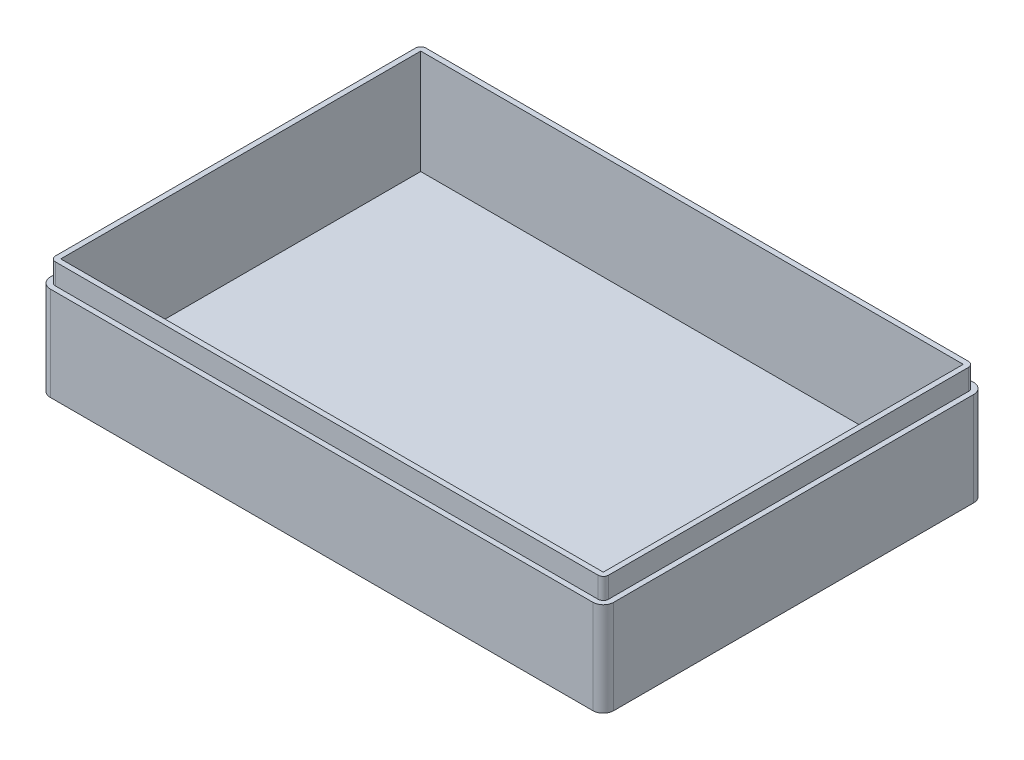
ISO-10303-21;
HEADER;
FILE_DESCRIPTION(('STEP AP214'),'2;1');
FILE_NAME('part.step','',(''),(''),'','','');
FILE_SCHEMA(('AUTOMOTIVE_DESIGN { 1 0 10303 214 1 1 1 1 }'));
ENDSEC;
DATA;
#1=APPLICATION_CONTEXT('core data for automotive mechanical design processes');
#2=APPLICATION_PROTOCOL_DEFINITION('international standard','automotive_design',2000,#1);
#3=PRODUCT_CONTEXT('',#1,'mechanical');
#4=PRODUCT('Part','Part','',(#3));
#5=PRODUCT_RELATED_PRODUCT_CATEGORY('part','',(#4));
#6=PRODUCT_DEFINITION_FORMATION('','',#4);
#7=PRODUCT_DEFINITION_CONTEXT('part definition',#1,'design');
#8=PRODUCT_DEFINITION('design','',#6,#7);
#9=PRODUCT_DEFINITION_SHAPE('','',#8);
#10=(LENGTH_UNIT() NAMED_UNIT(*) SI_UNIT(.MILLI.,.METRE.));
#11=(NAMED_UNIT(*) PLANE_ANGLE_UNIT() SI_UNIT($,.RADIAN.));
#12=(NAMED_UNIT(*) SI_UNIT($,.STERADIAN.) SOLID_ANGLE_UNIT());
#13=UNCERTAINTY_MEASURE_WITH_UNIT(LENGTH_MEASURE(1.E-05),#10,'distance_accuracy_value','');
#14=(GEOMETRIC_REPRESENTATION_CONTEXT(3) GLOBAL_UNCERTAINTY_ASSIGNED_CONTEXT((#13)) GLOBAL_UNIT_ASSIGNED_CONTEXT((#10,
#11,#12)) REPRESENTATION_CONTEXT('',''));
#15=CARTESIAN_POINT('',(0.,0.,0.));
#16=DIRECTION('',(0.,0.,1.));
#17=DIRECTION('',(1.,0.,0.));
#18=AXIS2_PLACEMENT_3D('',#15,#16,#17);
#19=CARTESIAN_POINT('',(0.,22.,0.));
#20=DIRECTION('',(0.,1.,0.));
#21=DIRECTION('',(0.,0.,1.));
#22=AXIS2_PLACEMENT_3D('',#19,#20,#21);
#23=PLANE('',#22);
#24=DIRECTION('',(-1.,0.,0.));
#25=VECTOR('',#24,1.);
#26=CARTESIAN_POINT('',(-54.,22.,-34.5));
#27=LINE('',#26,#25);
#28=CARTESIAN_POINT('',(52.,22.,-34.5));
#29=VERTEX_POINT('',#28);
#30=CARTESIAN_POINT('',(-52.,22.,-34.5));
#31=VERTEX_POINT('',#30);
#32=EDGE_CURVE('E281',#29,#31,#27,.T.);
#33=ORIENTED_EDGE('',*,*,#32,.F.);
#34=DIRECTION('',(0.,0.,-1.));
#35=VECTOR('',#34,1.);
#36=CARTESIAN_POINT('',(52.,22.,-36.5));
#37=LINE('',#36,#35);
#38=CARTESIAN_POINT('',(52.,22.,34.5));
#39=VERTEX_POINT('',#38);
#40=EDGE_CURVE('E278',#39,#29,#37,.T.);
#41=ORIENTED_EDGE('',*,*,#40,.F.);
#42=DIRECTION('',(1.,0.,0.));
#43=VECTOR('',#42,1.);
#44=CARTESIAN_POINT('',(-54.,22.,34.5));
#45=LINE('',#44,#43);
#46=CARTESIAN_POINT('',(-52.,22.,34.5));
#47=VERTEX_POINT('',#46);
#48=EDGE_CURVE('E276',#47,#39,#45,.T.);
#49=ORIENTED_EDGE('',*,*,#48,.F.);
#50=DIRECTION('',(0.,0.,1.));
#51=VECTOR('',#50,1.);
#52=CARTESIAN_POINT('',(-52.,22.,-36.5));
#53=LINE('',#52,#51);
#54=EDGE_CURVE('E284',#31,#47,#53,.T.);
#55=ORIENTED_EDGE('',*,*,#54,.F.);
#56=EDGE_LOOP('',(#33,#41,#49,#55));
#57=FACE_BOUND('',#56,.T.);
#58=DIRECTION('',(0.,0.,-1.));
#59=VECTOR('',#58,1.);
#60=CARTESIAN_POINT('',(53.,22.,34.5));
#61=LINE('',#60,#59);
#62=CARTESIAN_POINT('',(53.,22.,34.5));
#63=VERTEX_POINT('',#62);
#64=CARTESIAN_POINT('',(53.,22.,-34.5));
#65=VERTEX_POINT('',#64);
#66=EDGE_CURVE('E196',#63,#65,#61,.T.);
#67=ORIENTED_EDGE('',*,*,#66,.T.);
#68=CARTESIAN_POINT('',(52.,22.,-34.5));
#69=DIRECTION('',(0.,1.,0.));
#70=DIRECTION('',(0.,0.,1.));
#71=AXIS2_PLACEMENT_3D('',#68,#69,#70);
#72=CIRCLE('',#71,1.);
#73=CARTESIAN_POINT('',(52.,22.,-35.5));
#74=VERTEX_POINT('',#73);
#75=EDGE_CURVE('E216',#65,#74,#72,.T.);
#76=ORIENTED_EDGE('',*,*,#75,.T.);
#77=DIRECTION('',(-1.,0.,0.));
#78=VECTOR('',#77,1.);
#79=CARTESIAN_POINT('',(52.,22.,-35.5));
#80=LINE('',#79,#78);
#81=CARTESIAN_POINT('',(-52.,22.,-35.5));
#82=VERTEX_POINT('',#81);
#83=EDGE_CURVE('E176',#74,#82,#80,.T.);
#84=ORIENTED_EDGE('',*,*,#83,.T.);
#85=CARTESIAN_POINT('',(-52.,22.,-34.5));
#86=DIRECTION('',(0.,1.,0.));
#87=DIRECTION('',(0.,0.,1.));
#88=AXIS2_PLACEMENT_3D('',#85,#86,#87);
#89=CIRCLE('',#88,1.);
#90=CARTESIAN_POINT('',(-53.,22.,-34.5));
#91=VERTEX_POINT('',#90);
#92=EDGE_CURVE('E49',#82,#91,#89,.T.);
#93=ORIENTED_EDGE('',*,*,#92,.T.);
#94=DIRECTION('',(0.,0.,1.));
#95=VECTOR('',#94,1.);
#96=CARTESIAN_POINT('',(-53.,22.,-34.5));
#97=LINE('',#96,#95);
#98=CARTESIAN_POINT('',(-53.,22.,34.5));
#99=VERTEX_POINT('',#98);
#100=EDGE_CURVE('E220',#91,#99,#97,.T.);
#101=ORIENTED_EDGE('',*,*,#100,.T.);
#102=CARTESIAN_POINT('',(-52.,22.,34.5));
#103=DIRECTION('',(0.,1.,0.));
#104=DIRECTION('',(0.,0.,1.));
#105=AXIS2_PLACEMENT_3D('',#102,#103,#104);
#106=CIRCLE('',#105,1.);
#107=CARTESIAN_POINT('',(-52.,22.,35.5));
#108=VERTEX_POINT('',#107);
#109=EDGE_CURVE('E223',#99,#108,#106,.T.);
#110=ORIENTED_EDGE('',*,*,#109,.T.);
#111=DIRECTION('',(1.,0.,0.));
#112=VECTOR('',#111,1.);
#113=CARTESIAN_POINT('',(-52.,22.,35.5));
#114=LINE('',#113,#112);
#115=CARTESIAN_POINT('',(52.,22.,35.5));
#116=VERTEX_POINT('',#115);
#117=EDGE_CURVE('E226',#108,#116,#114,.T.);
#118=ORIENTED_EDGE('',*,*,#117,.T.);
#119=CARTESIAN_POINT('',(52.,22.,34.5));
#120=DIRECTION('',(0.,1.,0.));
#121=DIRECTION('',(0.,0.,1.));
#122=AXIS2_PLACEMENT_3D('',#119,#120,#121);
#123=CIRCLE('',#122,1.);
#124=EDGE_CURVE('E199',#116,#63,#123,.T.);
#125=ORIENTED_EDGE('',*,*,#124,.T.);
#126=EDGE_LOOP('',(#67,#76,#84,#93,#101,#110,#118,#125));
#127=FACE_BOUND('',#126,.T.);
#128=ADVANCED_FACE('F34',(#57,#127),#23,.T.);
#129=CARTESIAN_POINT('',(52.,22.,-36.5));
#130=DIRECTION('',(-1.,0.,0.));
#131=DIRECTION('',(0.,0.,1.));
#132=AXIS2_PLACEMENT_3D('',#129,#130,#131);
#133=PLANE('',#132);
#134=DIRECTION('',(0.,0.,-1.));
#135=VECTOR('',#134,1.);
#136=CARTESIAN_POINT('',(52.,2.,-36.5));
#137=LINE('',#136,#135);
#138=CARTESIAN_POINT('',(52.,2.,34.5));
#139=VERTEX_POINT('',#138);
#140=CARTESIAN_POINT('',(52.,2.,-34.5));
#141=VERTEX_POINT('',#140);
#142=EDGE_CURVE('E259',#139,#141,#137,.T.);
#143=ORIENTED_EDGE('',*,*,#142,.F.);
#144=DIRECTION('',(0.,1.,0.));
#145=VECTOR('',#144,1.);
#146=CARTESIAN_POINT('',(52.,22.,34.5));
#147=LINE('',#146,#145);
#148=EDGE_CURVE('E264',#139,#39,#147,.T.);
#149=ORIENTED_EDGE('',*,*,#148,.T.);
#150=ORIENTED_EDGE('',*,*,#40,.T.);
#151=DIRECTION('',(0.,1.,0.));
#152=VECTOR('',#151,1.);
#153=CARTESIAN_POINT('',(52.,22.,-34.5));
#154=LINE('',#153,#152);
#155=EDGE_CURVE('E262',#141,#29,#154,.T.);
#156=ORIENTED_EDGE('',*,*,#155,.F.);
#157=EDGE_LOOP('',(#143,#149,#150,#156));
#158=FACE_BOUND('',#157,.T.);
#159=ADVANCED_FACE('F371',(#158),#133,.T.);
#160=CARTESIAN_POINT('',(-54.,22.,-34.5));
#161=DIRECTION('',(0.,0.,1.));
#162=DIRECTION('',(1.,0.,0.));
#163=AXIS2_PLACEMENT_3D('',#160,#161,#162);
#164=PLANE('',#163);
#165=DIRECTION('',(-1.,0.,0.));
#166=VECTOR('',#165,1.);
#167=CARTESIAN_POINT('',(-54.,2.,-34.5));
#168=LINE('',#167,#166);
#169=CARTESIAN_POINT('',(-52.,2.,-34.5));
#170=VERTEX_POINT('',#169);
#171=EDGE_CURVE('E261',#141,#170,#168,.T.);
#172=ORIENTED_EDGE('',*,*,#171,.F.);
#173=ORIENTED_EDGE('',*,*,#155,.T.);
#174=ORIENTED_EDGE('',*,*,#32,.T.);
#175=DIRECTION('',(0.,1.,0.));
#176=VECTOR('',#175,1.);
#177=CARTESIAN_POINT('',(-52.,22.,-34.5));
#178=LINE('',#177,#176);
#179=EDGE_CURVE('E265',#170,#31,#178,.T.);
#180=ORIENTED_EDGE('',*,*,#179,.F.);
#181=EDGE_LOOP('',(#172,#173,#174,#180));
#182=FACE_BOUND('',#181,.T.);
#183=ADVANCED_FACE('F376',(#182),#164,.T.);
#184=CARTESIAN_POINT('',(-52.,22.,-36.5));
#185=DIRECTION('',(1.,0.,0.));
#186=DIRECTION('',(0.,0.,-1.));
#187=AXIS2_PLACEMENT_3D('',#184,#185,#186);
#188=PLANE('',#187);
#189=ORIENTED_EDGE('',*,*,#54,.T.);
#190=DIRECTION('',(0.,1.,0.));
#191=VECTOR('',#190,1.);
#192=CARTESIAN_POINT('',(-52.,22.,34.5));
#193=LINE('',#192,#191);
#194=CARTESIAN_POINT('',(-52.,2.,34.5));
#195=VERTEX_POINT('',#194);
#196=EDGE_CURVE('E272',#195,#47,#193,.T.);
#197=ORIENTED_EDGE('',*,*,#196,.F.);
#198=DIRECTION('',(0.,0.,1.));
#199=VECTOR('',#198,1.);
#200=CARTESIAN_POINT('',(-52.,2.,-36.5));
#201=LINE('',#200,#199);
#202=EDGE_CURVE('E270',#170,#195,#201,.T.);
#203=ORIENTED_EDGE('',*,*,#202,.F.);
#204=ORIENTED_EDGE('',*,*,#179,.T.);
#205=EDGE_LOOP('',(#189,#197,#203,#204));
#206=FACE_BOUND('',#205,.T.);
#207=ADVANCED_FACE('F389',(#206),#188,.T.);
#208=CARTESIAN_POINT('',(-54.,22.,34.5));
#209=DIRECTION('',(0.,0.,-1.));
#210=DIRECTION('',(-1.,0.,0.));
#211=AXIS2_PLACEMENT_3D('',#208,#209,#210);
#212=PLANE('',#211);
#213=DIRECTION('',(1.,0.,0.));
#214=VECTOR('',#213,1.);
#215=CARTESIAN_POINT('',(-54.,2.,34.5));
#216=LINE('',#215,#214);
#217=EDGE_CURVE('E274',#195,#139,#216,.T.);
#218=ORIENTED_EDGE('',*,*,#217,.F.);
#219=ORIENTED_EDGE('',*,*,#196,.T.);
#220=ORIENTED_EDGE('',*,*,#48,.T.);
#221=ORIENTED_EDGE('',*,*,#148,.F.);
#222=EDGE_LOOP('',(#218,#219,#220,#221));
#223=FACE_BOUND('',#222,.T.);
#224=ADVANCED_FACE('F385',(#223),#212,.T.);
#225=CARTESIAN_POINT('',(0.,2.,0.));
#226=DIRECTION('',(0.,1.,0.));
#227=DIRECTION('',(0.,0.,1.));
#228=AXIS2_PLACEMENT_3D('',#225,#226,#227);
#229=PLANE('',#228);
#230=ORIENTED_EDGE('',*,*,#202,.T.);
#231=ORIENTED_EDGE('',*,*,#217,.T.);
#232=ORIENTED_EDGE('',*,*,#142,.T.);
#233=ORIENTED_EDGE('',*,*,#171,.T.);
#234=EDGE_LOOP('',(#230,#231,#232,#233));
#235=FACE_BOUND('',#234,.T.);
#236=ADVANCED_FACE('F382',(#235),#229,.T.);
#237=CARTESIAN_POINT('',(0.,18.,0.));
#238=DIRECTION('',(0.,1.,0.));
#239=DIRECTION('',(0.,0.,1.));
#240=AXIS2_PLACEMENT_3D('',#237,#238,#239);
#241=PLANE('',#240);
#242=DIRECTION('',(-1.,0.,0.));
#243=VECTOR('',#242,1.);
#244=CARTESIAN_POINT('',(-54.,18.,-36.5));
#245=LINE('',#244,#243);
#246=CARTESIAN_POINT('',(52.,18.,-36.5));
#247=VERTEX_POINT('',#246);
#248=CARTESIAN_POINT('',(-52.,18.,-36.5));
#249=VERTEX_POINT('',#248);
#250=EDGE_CURVE('E252',#247,#249,#245,.T.);
#251=ORIENTED_EDGE('',*,*,#250,.T.);
#252=CARTESIAN_POINT('',(-52.,18.,-34.5));
#253=DIRECTION('',(0.,1.,0.));
#254=DIRECTION('',(0.,0.,1.));
#255=AXIS2_PLACEMENT_3D('',#252,#253,#254);
#256=CIRCLE('',#255,2.);
#257=CARTESIAN_POINT('',(-54.,18.,-34.5));
#258=VERTEX_POINT('',#257);
#259=EDGE_CURVE('E249',#258,#249,#256,.F.);
#260=ORIENTED_EDGE('',*,*,#259,.F.);
#261=DIRECTION('',(0.,0.,1.));
#262=VECTOR('',#261,1.);
#263=CARTESIAN_POINT('',(-54.,18.,-36.5));
#264=LINE('',#263,#262);
#265=CARTESIAN_POINT('',(-54.,18.,34.5));
#266=VERTEX_POINT('',#265);
#267=EDGE_CURVE('E57',#258,#266,#264,.T.);
#268=ORIENTED_EDGE('',*,*,#267,.T.);
#269=CARTESIAN_POINT('',(-52.,18.,34.5));
#270=DIRECTION('',(0.,1.,0.));
#271=DIRECTION('',(0.,0.,1.));
#272=AXIS2_PLACEMENT_3D('',#269,#270,#271);
#273=CIRCLE('',#272,2.);
#274=CARTESIAN_POINT('',(-52.,18.,36.5));
#275=VERTEX_POINT('',#274);
#276=EDGE_CURVE('E12',#275,#266,#273,.F.);
#277=ORIENTED_EDGE('',*,*,#276,.F.);
#278=DIRECTION('',(1.,0.,0.));
#279=VECTOR('',#278,1.);
#280=CARTESIAN_POINT('',(-54.,18.,36.5));
#281=LINE('',#280,#279);
#282=CARTESIAN_POINT('',(52.,18.,36.5));
#283=VERTEX_POINT('',#282);
#284=EDGE_CURVE('E232',#275,#283,#281,.T.);
#285=ORIENTED_EDGE('',*,*,#284,.T.);
#286=CARTESIAN_POINT('',(52.,18.,34.5));
#287=DIRECTION('',(0.,1.,0.));
#288=DIRECTION('',(0.,0.,1.));
#289=AXIS2_PLACEMENT_3D('',#286,#287,#288);
#290=CIRCLE('',#289,2.);
#291=CARTESIAN_POINT('',(54.,18.,34.5));
#292=VERTEX_POINT('',#291);
#293=EDGE_CURVE('E246',#292,#283,#290,.F.);
#294=ORIENTED_EDGE('',*,*,#293,.F.);
#295=DIRECTION('',(0.,0.,-1.));
#296=VECTOR('',#295,1.);
#297=CARTESIAN_POINT('',(54.,18.,-36.5));
#298=LINE('',#297,#296);
#299=CARTESIAN_POINT('',(54.,18.,-34.5));
#300=VERTEX_POINT('',#299);
#301=EDGE_CURVE('E254',#292,#300,#298,.T.);
#302=ORIENTED_EDGE('',*,*,#301,.T.);
#303=CARTESIAN_POINT('',(52.,18.,-34.5));
#304=DIRECTION('',(0.,1.,0.));
#305=DIRECTION('',(0.,0.,1.));
#306=AXIS2_PLACEMENT_3D('',#303,#304,#305);
#307=CIRCLE('',#306,2.);
#308=EDGE_CURVE('E256',#247,#300,#307,.F.);
#309=ORIENTED_EDGE('',*,*,#308,.F.);
#310=EDGE_LOOP('',(#251,#260,#268,#277,#285,#294,#302,#309));
#311=FACE_BOUND('',#310,.T.);
#312=DIRECTION('',(0.,0.,-1.));
#313=VECTOR('',#312,1.);
#314=CARTESIAN_POINT('',(53.,18.,34.5));
#315=LINE('',#314,#313);
#316=CARTESIAN_POINT('',(53.,18.,34.5));
#317=VERTEX_POINT('',#316);
#318=CARTESIAN_POINT('',(53.,18.,-34.5));
#319=VERTEX_POINT('',#318);
#320=EDGE_CURVE('E182',#317,#319,#315,.T.);
#321=ORIENTED_EDGE('',*,*,#320,.F.);
#322=CARTESIAN_POINT('',(52.,18.,34.5));
#323=DIRECTION('',(0.,1.,0.));
#324=DIRECTION('',(0.,0.,1.));
#325=AXIS2_PLACEMENT_3D('',#322,#323,#324);
#326=CIRCLE('',#325,1.);
#327=CARTESIAN_POINT('',(52.,18.,35.5));
#328=VERTEX_POINT('',#327);
#329=EDGE_CURVE('E212',#328,#317,#326,.T.);
#330=ORIENTED_EDGE('',*,*,#329,.F.);
#331=DIRECTION('',(1.,0.,0.));
#332=VECTOR('',#331,1.);
#333=CARTESIAN_POINT('',(-52.,18.,35.5));
#334=LINE('',#333,#332);
#335=CARTESIAN_POINT('',(-52.,18.,35.5));
#336=VERTEX_POINT('',#335);
#337=EDGE_CURVE('E209',#336,#328,#334,.T.);
#338=ORIENTED_EDGE('',*,*,#337,.F.);
#339=CARTESIAN_POINT('',(-52.,18.,34.5));
#340=DIRECTION('',(0.,1.,0.));
#341=DIRECTION('',(0.,0.,1.));
#342=AXIS2_PLACEMENT_3D('',#339,#340,#341);
#343=CIRCLE('',#342,1.);
#344=CARTESIAN_POINT('',(-53.,18.,34.5));
#345=VERTEX_POINT('',#344);
#346=EDGE_CURVE('E206',#345,#336,#343,.T.);
#347=ORIENTED_EDGE('',*,*,#346,.F.);
#348=DIRECTION('',(0.,0.,1.));
#349=VECTOR('',#348,1.);
#350=CARTESIAN_POINT('',(-53.,18.,-34.5));
#351=LINE('',#350,#349);
#352=CARTESIAN_POINT('',(-53.,18.,-34.5));
#353=VERTEX_POINT('',#352);
#354=EDGE_CURVE('E203',#353,#345,#351,.T.);
#355=ORIENTED_EDGE('',*,*,#354,.F.);
#356=CARTESIAN_POINT('',(-52.,18.,-34.5));
#357=DIRECTION('',(0.,1.,0.));
#358=DIRECTION('',(0.,0.,1.));
#359=AXIS2_PLACEMENT_3D('',#356,#357,#358);
#360=CIRCLE('',#359,1.);
#361=CARTESIAN_POINT('',(-52.,18.,-35.5));
#362=VERTEX_POINT('',#361);
#363=EDGE_CURVE('E192',#362,#353,#360,.T.);
#364=ORIENTED_EDGE('',*,*,#363,.F.);
#365=DIRECTION('',(-1.,0.,0.));
#366=VECTOR('',#365,1.);
#367=CARTESIAN_POINT('',(52.,18.,-35.5));
#368=LINE('',#367,#366);
#369=CARTESIAN_POINT('',(52.,18.,-35.5));
#370=VERTEX_POINT('',#369);
#371=EDGE_CURVE('E174',#370,#362,#368,.T.);
#372=ORIENTED_EDGE('',*,*,#371,.F.);
#373=CARTESIAN_POINT('',(52.,18.,-34.5));
#374=DIRECTION('',(0.,1.,0.));
#375=DIRECTION('',(0.,0.,1.));
#376=AXIS2_PLACEMENT_3D('',#373,#374,#375);
#377=CIRCLE('',#376,1.);
#378=EDGE_CURVE('E188',#319,#370,#377,.T.);
#379=ORIENTED_EDGE('',*,*,#378,.F.);
#380=EDGE_LOOP('',(#321,#330,#338,#347,#355,#364,#372,#379));
#381=FACE_BOUND('',#380,.T.);
#382=ADVANCED_FACE('F187',(#311,#381),#241,.T.);
#383=CARTESIAN_POINT('',(52.,18.,-34.5));
#384=DIRECTION('',(0.,1.,0.));
#385=DIRECTION('',(0.,0.,1.));
#386=AXIS2_PLACEMENT_3D('',#383,#384,#385);
#387=CYLINDRICAL_SURFACE('',#386,1.);
#388=ORIENTED_EDGE('',*,*,#75,.F.);
#389=DIRECTION('',(0.,1.,0.));
#390=VECTOR('',#389,1.);
#391=CARTESIAN_POINT('',(53.,18.,-34.5));
#392=LINE('',#391,#390);
#393=EDGE_CURVE('E195',#319,#65,#392,.T.);
#394=ORIENTED_EDGE('',*,*,#393,.F.);
#395=ORIENTED_EDGE('',*,*,#378,.T.);
#396=DIRECTION('',(0.,1.,0.));
#397=VECTOR('',#396,1.);
#398=CARTESIAN_POINT('',(52.,18.,-35.5));
#399=LINE('',#398,#397);
#400=EDGE_CURVE('E171',#370,#74,#399,.T.);
#401=ORIENTED_EDGE('',*,*,#400,.T.);
#402=EDGE_LOOP('',(#388,#394,#395,#401));
#403=FACE_BOUND('',#402,.T.);
#404=ADVANCED_FACE('F194',(#403),#387,.T.);
#405=CARTESIAN_POINT('',(53.,18.,34.5));
#406=DIRECTION('',(1.,0.,0.));
#407=DIRECTION('',(0.,0.,-1.));
#408=AXIS2_PLACEMENT_3D('',#405,#406,#407);
#409=PLANE('',#408);
#410=ORIENTED_EDGE('',*,*,#66,.F.);
#411=DIRECTION('',(0.,1.,0.));
#412=VECTOR('',#411,1.);
#413=CARTESIAN_POINT('',(53.,18.,34.5));
#414=LINE('',#413,#412);
#415=EDGE_CURVE('E233',#317,#63,#414,.T.);
#416=ORIENTED_EDGE('',*,*,#415,.F.);
#417=ORIENTED_EDGE('',*,*,#320,.T.);
#418=ORIENTED_EDGE('',*,*,#393,.T.);
#419=EDGE_LOOP('',(#410,#416,#417,#418));
#420=FACE_BOUND('',#419,.T.);
#421=ADVANCED_FACE('F400',(#420),#409,.T.);
#422=CARTESIAN_POINT('',(52.,18.,34.5));
#423=DIRECTION('',(0.,1.,0.));
#424=DIRECTION('',(0.,0.,1.));
#425=AXIS2_PLACEMENT_3D('',#422,#423,#424);
#426=CYLINDRICAL_SURFACE('',#425,1.);
#427=ORIENTED_EDGE('',*,*,#124,.F.);
#428=DIRECTION('',(0.,1.,0.));
#429=VECTOR('',#428,1.);
#430=CARTESIAN_POINT('',(52.,18.,35.5));
#431=LINE('',#430,#429);
#432=EDGE_CURVE('E235',#328,#116,#431,.T.);
#433=ORIENTED_EDGE('',*,*,#432,.F.);
#434=ORIENTED_EDGE('',*,*,#329,.T.);
#435=ORIENTED_EDGE('',*,*,#415,.T.);
#436=EDGE_LOOP('',(#427,#433,#434,#435));
#437=FACE_BOUND('',#436,.T.);
#438=ADVANCED_FACE('F415',(#437),#426,.T.);
#439=CARTESIAN_POINT('',(-52.,18.,35.5));
#440=DIRECTION('',(0.,0.,1.));
#441=DIRECTION('',(1.,0.,0.));
#442=AXIS2_PLACEMENT_3D('',#439,#440,#441);
#443=PLANE('',#442);
#444=ORIENTED_EDGE('',*,*,#117,.F.);
#445=DIRECTION('',(0.,1.,0.));
#446=VECTOR('',#445,1.);
#447=CARTESIAN_POINT('',(-52.,18.,35.5));
#448=LINE('',#447,#446);
#449=EDGE_CURVE('E237',#336,#108,#448,.T.);
#450=ORIENTED_EDGE('',*,*,#449,.F.);
#451=ORIENTED_EDGE('',*,*,#337,.T.);
#452=ORIENTED_EDGE('',*,*,#432,.T.);
#453=EDGE_LOOP('',(#444,#450,#451,#452));
#454=FACE_BOUND('',#453,.T.);
#455=ADVANCED_FACE('F411',(#454),#443,.T.);
#456=CARTESIAN_POINT('',(-52.,18.,34.5));
#457=DIRECTION('',(0.,1.,0.));
#458=DIRECTION('',(0.,0.,1.));
#459=AXIS2_PLACEMENT_3D('',#456,#457,#458);
#460=CYLINDRICAL_SURFACE('',#459,1.);
#461=ORIENTED_EDGE('',*,*,#109,.F.);
#462=DIRECTION('',(0.,1.,0.));
#463=VECTOR('',#462,1.);
#464=CARTESIAN_POINT('',(-53.,18.,34.5));
#465=LINE('',#464,#463);
#466=EDGE_CURVE('E239',#345,#99,#465,.T.);
#467=ORIENTED_EDGE('',*,*,#466,.F.);
#468=ORIENTED_EDGE('',*,*,#346,.T.);
#469=ORIENTED_EDGE('',*,*,#449,.T.);
#470=EDGE_LOOP('',(#461,#467,#468,#469));
#471=FACE_BOUND('',#470,.T.);
#472=ADVANCED_FACE('F407',(#471),#460,.T.);
#473=CARTESIAN_POINT('',(-53.,18.,-34.5));
#474=DIRECTION('',(-1.,0.,0.));
#475=DIRECTION('',(0.,0.,1.));
#476=AXIS2_PLACEMENT_3D('',#473,#474,#475);
#477=PLANE('',#476);
#478=ORIENTED_EDGE('',*,*,#100,.F.);
#479=DIRECTION('',(0.,1.,0.));
#480=VECTOR('',#479,1.);
#481=CARTESIAN_POINT('',(-53.,18.,-34.5));
#482=LINE('',#481,#480);
#483=EDGE_CURVE('E241',#353,#91,#482,.T.);
#484=ORIENTED_EDGE('',*,*,#483,.F.);
#485=ORIENTED_EDGE('',*,*,#354,.T.);
#486=ORIENTED_EDGE('',*,*,#466,.T.);
#487=EDGE_LOOP('',(#478,#484,#485,#486));
#488=FACE_BOUND('',#487,.T.);
#489=ADVANCED_FACE('F404',(#488),#477,.T.);
#490=CARTESIAN_POINT('',(-52.,18.,-34.5));
#491=DIRECTION('',(0.,1.,0.));
#492=DIRECTION('',(0.,0.,1.));
#493=AXIS2_PLACEMENT_3D('',#490,#491,#492);
#494=CYLINDRICAL_SURFACE('',#493,1.);
#495=ORIENTED_EDGE('',*,*,#92,.F.);
#496=DIRECTION('',(0.,1.,0.));
#497=VECTOR('',#496,1.);
#498=CARTESIAN_POINT('',(-52.,18.,-35.5));
#499=LINE('',#498,#497);
#500=EDGE_CURVE('E181',#362,#82,#499,.T.);
#501=ORIENTED_EDGE('',*,*,#500,.F.);
#502=ORIENTED_EDGE('',*,*,#363,.T.);
#503=ORIENTED_EDGE('',*,*,#483,.T.);
#504=EDGE_LOOP('',(#495,#501,#502,#503));
#505=FACE_BOUND('',#504,.T.);
#506=ADVANCED_FACE('F366',(#505),#494,.T.);
#507=CARTESIAN_POINT('',(52.,18.,-35.5));
#508=DIRECTION('',(0.,0.,-1.));
#509=DIRECTION('',(-1.,0.,0.));
#510=AXIS2_PLACEMENT_3D('',#507,#508,#509);
#511=PLANE('',#510);
#512=ORIENTED_EDGE('',*,*,#83,.F.);
#513=ORIENTED_EDGE('',*,*,#400,.F.);
#514=ORIENTED_EDGE('',*,*,#371,.T.);
#515=ORIENTED_EDGE('',*,*,#500,.T.);
#516=EDGE_LOOP('',(#512,#513,#514,#515));
#517=FACE_BOUND('',#516,.T.);
#518=ADVANCED_FACE('F173',(#517),#511,.T.);
#519=CARTESIAN_POINT('',(0.,0.,0.));
#520=DIRECTION('',(0.,1.,0.));
#521=DIRECTION('',(0.,0.,1.));
#522=AXIS2_PLACEMENT_3D('',#519,#520,#521);
#523=PLANE('',#522);
#524=DIRECTION('',(0.,0.,1.));
#525=VECTOR('',#524,1.);
#526=CARTESIAN_POINT('',(-54.,0.,-36.5));
#527=LINE('',#526,#525);
#528=CARTESIAN_POINT('',(-54.,0.,-34.5));
#529=VERTEX_POINT('',#528);
#530=CARTESIAN_POINT('',(-54.,0.,34.5));
#531=VERTEX_POINT('',#530);
#532=EDGE_CURVE('E293',#529,#531,#527,.T.);
#533=ORIENTED_EDGE('',*,*,#532,.F.);
#534=CARTESIAN_POINT('',(-52.,0.,-34.5));
#535=DIRECTION('',(0.,1.,0.));
#536=DIRECTION('',(0.,0.,1.));
#537=AXIS2_PLACEMENT_3D('',#534,#535,#536);
#538=CIRCLE('',#537,2.);
#539=CARTESIAN_POINT('',(-52.,0.,-36.5));
#540=VERTEX_POINT('',#539);
#541=EDGE_CURVE('E310',#529,#540,#538,.F.);
#542=ORIENTED_EDGE('',*,*,#541,.T.);
#543=DIRECTION('',(-1.,0.,0.));
#544=VECTOR('',#543,1.);
#545=CARTESIAN_POINT('',(-54.,0.,-36.5));
#546=LINE('',#545,#544);
#547=CARTESIAN_POINT('',(52.,0.,-36.5));
#548=VERTEX_POINT('',#547);
#549=EDGE_CURVE('E290',#548,#540,#546,.T.);
#550=ORIENTED_EDGE('',*,*,#549,.F.);
#551=CARTESIAN_POINT('',(52.,0.,-34.5));
#552=DIRECTION('',(0.,1.,0.));
#553=DIRECTION('',(0.,0.,1.));
#554=AXIS2_PLACEMENT_3D('',#551,#552,#553);
#555=CIRCLE('',#554,2.);
#556=CARTESIAN_POINT('',(54.,0.,-34.5));
#557=VERTEX_POINT('',#556);
#558=EDGE_CURVE('E308',#548,#557,#555,.F.);
#559=ORIENTED_EDGE('',*,*,#558,.T.);
#560=DIRECTION('',(0.,0.,-1.));
#561=VECTOR('',#560,1.);
#562=CARTESIAN_POINT('',(54.,0.,-36.5));
#563=LINE('',#562,#561);
#564=CARTESIAN_POINT('',(54.,0.,34.5));
#565=VERTEX_POINT('',#564);
#566=EDGE_CURVE('E268',#565,#557,#563,.T.);
#567=ORIENTED_EDGE('',*,*,#566,.F.);
#568=CARTESIAN_POINT('',(52.,0.,34.5));
#569=DIRECTION('',(0.,1.,0.));
#570=DIRECTION('',(0.,0.,1.));
#571=AXIS2_PLACEMENT_3D('',#568,#569,#570);
#572=CIRCLE('',#571,2.);
#573=CARTESIAN_POINT('',(52.,0.,36.5));
#574=VERTEX_POINT('',#573);
#575=EDGE_CURVE('E306',#565,#574,#572,.F.);
#576=ORIENTED_EDGE('',*,*,#575,.T.);
#577=DIRECTION('',(1.,0.,0.));
#578=VECTOR('',#577,1.);
#579=CARTESIAN_POINT('',(-54.,0.,36.5));
#580=LINE('',#579,#578);
#581=CARTESIAN_POINT('',(-52.,0.,36.5));
#582=VERTEX_POINT('',#581);
#583=EDGE_CURVE('E296',#582,#574,#580,.T.);
#584=ORIENTED_EDGE('',*,*,#583,.F.);
#585=CARTESIAN_POINT('',(-52.,0.,34.5));
#586=DIRECTION('',(0.,1.,0.));
#587=DIRECTION('',(0.,0.,1.));
#588=AXIS2_PLACEMENT_3D('',#585,#586,#587);
#589=CIRCLE('',#588,2.);
#590=EDGE_CURVE('E304',#582,#531,#589,.F.);
#591=ORIENTED_EDGE('',*,*,#590,.T.);
#592=EDGE_LOOP('',(#533,#542,#550,#559,#567,#576,#584,#591));
#593=FACE_BOUND('',#592,.T.);
#594=ADVANCED_FACE('F359',(#593),#523,.F.);
#595=CARTESIAN_POINT('',(52.,22.,34.5));
#596=DIRECTION('',(0.,-1.,0.));
#597=DIRECTION('',(0.,0.,-1.));
#598=AXIS2_PLACEMENT_3D('',#595,#596,#597);
#599=CYLINDRICAL_SURFACE('',#598,2.);
#600=DIRECTION('',(0.,-1.,0.));
#601=VECTOR('',#600,1.);
#602=CARTESIAN_POINT('',(54.,22.,34.5));
#603=LINE('',#602,#601);
#604=EDGE_CURVE('E317',#292,#565,#603,.T.);
#605=ORIENTED_EDGE('',*,*,#604,.F.);
#606=ORIENTED_EDGE('',*,*,#293,.T.);
#607=DIRECTION('',(0.,-1.,0.));
#608=VECTOR('',#607,1.);
#609=CARTESIAN_POINT('',(52.,22.,36.5));
#610=LINE('',#609,#608);
#611=EDGE_CURVE('E42',#574,#283,#610,.F.);
#612=ORIENTED_EDGE('',*,*,#611,.F.);
#613=ORIENTED_EDGE('',*,*,#575,.F.);
#614=EDGE_LOOP('',(#605,#606,#612,#613));
#615=FACE_BOUND('',#614,.T.);
#616=ADVANCED_FACE('F333',(#615),#599,.T.);
#617=CARTESIAN_POINT('',(-52.,22.,34.5));
#618=DIRECTION('',(0.,-1.,0.));
#619=DIRECTION('',(0.,0.,-1.));
#620=AXIS2_PLACEMENT_3D('',#617,#618,#619);
#621=CYLINDRICAL_SURFACE('',#620,2.);
#622=DIRECTION('',(0.,-1.,0.));
#623=VECTOR('',#622,1.);
#624=CARTESIAN_POINT('',(-52.,22.,36.5));
#625=LINE('',#624,#623);
#626=EDGE_CURVE('E322',#275,#582,#625,.T.);
#627=ORIENTED_EDGE('',*,*,#626,.F.);
#628=ORIENTED_EDGE('',*,*,#276,.T.);
#629=DIRECTION('',(0.,-1.,0.));
#630=VECTOR('',#629,1.);
#631=CARTESIAN_POINT('',(-54.,22.,34.5));
#632=LINE('',#631,#630);
#633=EDGE_CURVE('E299',#531,#266,#632,.F.);
#634=ORIENTED_EDGE('',*,*,#633,.F.);
#635=ORIENTED_EDGE('',*,*,#590,.F.);
#636=EDGE_LOOP('',(#627,#628,#634,#635));
#637=FACE_BOUND('',#636,.T.);
#638=ADVANCED_FACE('F36',(#637),#621,.T.);
#639=CARTESIAN_POINT('',(-54.,22.,36.5));
#640=DIRECTION('',(0.,0.,-1.));
#641=DIRECTION('',(-1.,0.,0.));
#642=AXIS2_PLACEMENT_3D('',#639,#640,#641);
#643=PLANE('',#642);
#644=ORIENTED_EDGE('',*,*,#284,.F.);
#645=ORIENTED_EDGE('',*,*,#626,.T.);
#646=ORIENTED_EDGE('',*,*,#583,.T.);
#647=ORIENTED_EDGE('',*,*,#611,.T.);
#648=EDGE_LOOP('',(#644,#645,#646,#647));
#649=FACE_BOUND('',#648,.T.);
#650=ADVANCED_FACE('F327',(#649),#643,.F.);
#651=CARTESIAN_POINT('',(-52.,22.,-34.5));
#652=DIRECTION('',(0.,-1.,0.));
#653=DIRECTION('',(0.,0.,-1.));
#654=AXIS2_PLACEMENT_3D('',#651,#652,#653);
#655=CYLINDRICAL_SURFACE('',#654,2.);
#656=DIRECTION('',(0.,-1.,0.));
#657=VECTOR('',#656,1.);
#658=CARTESIAN_POINT('',(-54.,22.,-34.5));
#659=LINE('',#658,#657);
#660=EDGE_CURVE('E302',#258,#529,#659,.T.);
#661=ORIENTED_EDGE('',*,*,#660,.F.);
#662=ORIENTED_EDGE('',*,*,#259,.T.);
#663=DIRECTION('',(0.,-1.,0.));
#664=VECTOR('',#663,1.);
#665=CARTESIAN_POINT('',(-52.,22.,-36.5));
#666=LINE('',#665,#664);
#667=EDGE_CURVE('E314',#540,#249,#666,.F.);
#668=ORIENTED_EDGE('',*,*,#667,.F.);
#669=ORIENTED_EDGE('',*,*,#541,.F.);
#670=EDGE_LOOP('',(#661,#662,#668,#669));
#671=FACE_BOUND('',#670,.T.);
#672=ADVANCED_FACE('F351',(#671),#655,.T.);
#673=CARTESIAN_POINT('',(-54.,22.,-36.5));
#674=DIRECTION('',(1.,0.,0.));
#675=DIRECTION('',(0.,0.,-1.));
#676=AXIS2_PLACEMENT_3D('',#673,#674,#675);
#677=PLANE('',#676);
#678=ORIENTED_EDGE('',*,*,#267,.F.);
#679=ORIENTED_EDGE('',*,*,#660,.T.);
#680=ORIENTED_EDGE('',*,*,#532,.T.);
#681=ORIENTED_EDGE('',*,*,#633,.T.);
#682=EDGE_LOOP('',(#678,#679,#680,#681));
#683=FACE_BOUND('',#682,.T.);
#684=ADVANCED_FACE('F354',(#683),#677,.F.);
#685=CARTESIAN_POINT('',(52.,22.,-34.5));
#686=DIRECTION('',(0.,-1.,0.));
#687=DIRECTION('',(0.,0.,-1.));
#688=AXIS2_PLACEMENT_3D('',#685,#686,#687);
#689=CYLINDRICAL_SURFACE('',#688,2.);
#690=DIRECTION('',(0.,-1.,0.));
#691=VECTOR('',#690,1.);
#692=CARTESIAN_POINT('',(52.,22.,-36.5));
#693=LINE('',#692,#691);
#694=EDGE_CURVE('E312',#247,#548,#693,.T.);
#695=ORIENTED_EDGE('',*,*,#694,.F.);
#696=ORIENTED_EDGE('',*,*,#308,.T.);
#697=DIRECTION('',(0.,-1.,0.));
#698=VECTOR('',#697,1.);
#699=CARTESIAN_POINT('',(54.,22.,-34.5));
#700=LINE('',#699,#698);
#701=EDGE_CURVE('E319',#557,#300,#700,.F.);
#702=ORIENTED_EDGE('',*,*,#701,.F.);
#703=ORIENTED_EDGE('',*,*,#558,.F.);
#704=EDGE_LOOP('',(#695,#696,#702,#703));
#705=FACE_BOUND('',#704,.T.);
#706=ADVANCED_FACE('F342',(#705),#689,.T.);
#707=CARTESIAN_POINT('',(-54.,22.,-36.5));
#708=DIRECTION('',(0.,0.,1.));
#709=DIRECTION('',(1.,0.,0.));
#710=AXIS2_PLACEMENT_3D('',#707,#708,#709);
#711=PLANE('',#710);
#712=ORIENTED_EDGE('',*,*,#250,.F.);
#713=ORIENTED_EDGE('',*,*,#694,.T.);
#714=ORIENTED_EDGE('',*,*,#549,.T.);
#715=ORIENTED_EDGE('',*,*,#667,.T.);
#716=EDGE_LOOP('',(#712,#713,#714,#715));
#717=FACE_BOUND('',#716,.T.);
#718=ADVANCED_FACE('F346',(#717),#711,.F.);
#719=CARTESIAN_POINT('',(54.,22.,-36.5));
#720=DIRECTION('',(-1.,0.,0.));
#721=DIRECTION('',(0.,0.,1.));
#722=AXIS2_PLACEMENT_3D('',#719,#720,#721);
#723=PLANE('',#722);
#724=ORIENTED_EDGE('',*,*,#301,.F.);
#725=ORIENTED_EDGE('',*,*,#604,.T.);
#726=ORIENTED_EDGE('',*,*,#566,.T.);
#727=ORIENTED_EDGE('',*,*,#701,.T.);
#728=EDGE_LOOP('',(#724,#725,#726,#727));
#729=FACE_BOUND('',#728,.T.);
#730=ADVANCED_FACE('F337',(#729),#723,.F.);
#731=CLOSED_SHELL('',(#128,#159,#183,#207,#224,#236,#382,#404,#421,#438,#455,#472,#489,#506,
#518,#594,#616,#638,#650,#672,#684,#706,#718,#730));
#732=MANIFOLD_SOLID_BREP('B2',#731);
#733=ADVANCED_BREP_SHAPE_REPRESENTATION('',(#18,#732),#14);
#734=SHAPE_DEFINITION_REPRESENTATION(#9,#733);
ENDSEC;
END-ISO-10303-21;
